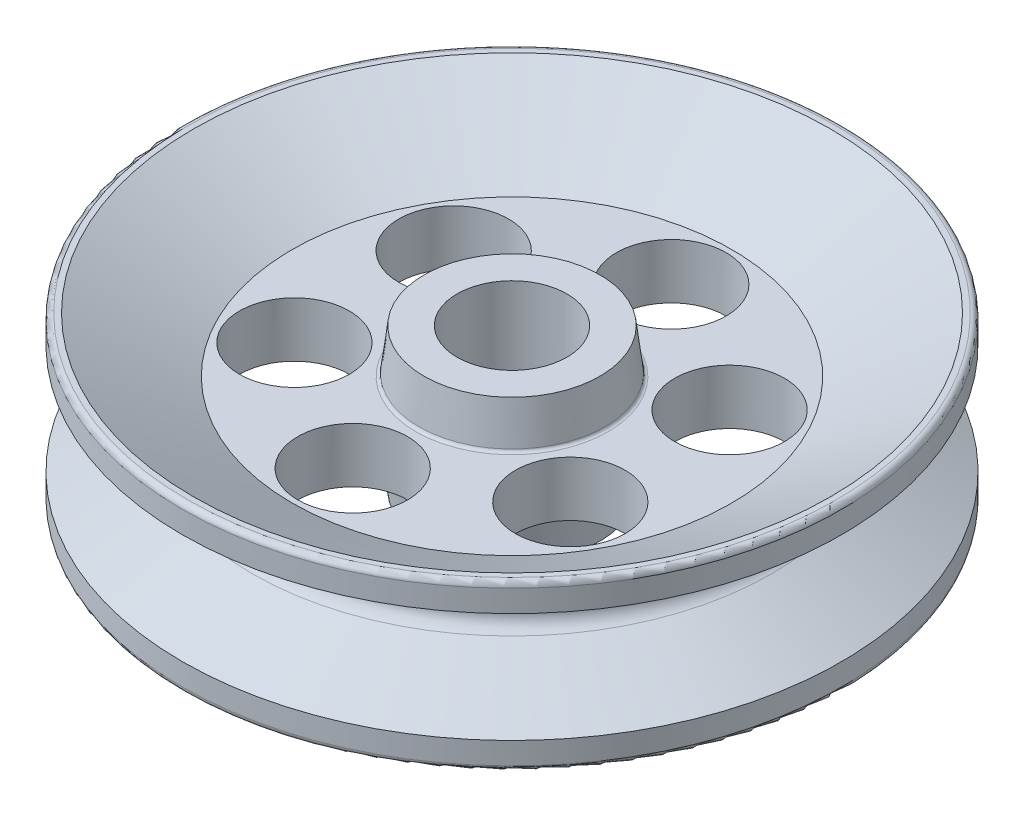
ISO-10303-21;
HEADER;
FILE_DESCRIPTION(('STEP AP214'),'2;1');
FILE_NAME('part.step','',(''),(''),'','','');
FILE_SCHEMA(('AUTOMOTIVE_DESIGN { 1 0 10303 214 1 1 1 1 }'));
ENDSEC;
DATA;
#1=APPLICATION_CONTEXT('core data for automotive mechanical design processes');
#2=APPLICATION_PROTOCOL_DEFINITION('international standard','automotive_design',2000,#1);
#3=PRODUCT_CONTEXT('',#1,'mechanical');
#4=PRODUCT('Part','Part','',(#3));
#5=PRODUCT_RELATED_PRODUCT_CATEGORY('part','',(#4));
#6=PRODUCT_DEFINITION_FORMATION('','',#4);
#7=PRODUCT_DEFINITION_CONTEXT('part definition',#1,'design');
#8=PRODUCT_DEFINITION('design','',#6,#7);
#9=PRODUCT_DEFINITION_SHAPE('','',#8);
#10=(LENGTH_UNIT() NAMED_UNIT(*) SI_UNIT(.MILLI.,.METRE.));
#11=(NAMED_UNIT(*) PLANE_ANGLE_UNIT() SI_UNIT($,.RADIAN.));
#12=(NAMED_UNIT(*) SI_UNIT($,.STERADIAN.) SOLID_ANGLE_UNIT());
#13=UNCERTAINTY_MEASURE_WITH_UNIT(LENGTH_MEASURE(1.E-05),#10,'distance_accuracy_value','');
#14=(GEOMETRIC_REPRESENTATION_CONTEXT(3) GLOBAL_UNCERTAINTY_ASSIGNED_CONTEXT((#13)) GLOBAL_UNIT_ASSIGNED_CONTEXT((#10,
#11,#12)) REPRESENTATION_CONTEXT('',''));
#15=CARTESIAN_POINT('',(0.,0.,0.));
#16=DIRECTION('',(0.,0.,1.));
#17=DIRECTION('',(1.,0.,0.));
#18=AXIS2_PLACEMENT_3D('',#15,#16,#17);
#19=CARTESIAN_POINT('',(0.,-381.,0.));
#20=DIRECTION('',(0.,1.,0.));
#21=DIRECTION('',(0.,0.,1.));
#22=AXIS2_PLACEMENT_3D('',#19,#20,#21);
#23=CYLINDRICAL_SURFACE('',#22,254.);
#24=CARTESIAN_POINT('',(0.,-330.2,0.));
#25=DIRECTION('',(0.,-1.,0.));
#26=DIRECTION('',(0.,0.,-1.));
#27=AXIS2_PLACEMENT_3D('',#24,#25,#26);
#28=CIRCLE('',#27,254.);
#29=CARTESIAN_POINT('',(0.,-330.2,-254.));
#30=VERTEX_POINT('',#29);
#31=EDGE_CURVE('E67',#30,#30,#28,.F.);
#32=ORIENTED_EDGE('',*,*,#31,.F.);
#33=EDGE_LOOP('',(#32));
#34=FACE_BOUND('',#33,.T.);
#35=CARTESIAN_POINT('',(0.,330.2,0.));
#36=DIRECTION('',(0.,1.,0.));
#37=DIRECTION('',(0.,0.,1.));
#38=AXIS2_PLACEMENT_3D('',#35,#36,#37);
#39=CIRCLE('',#38,254.);
#40=CARTESIAN_POINT('',(0.,330.2,254.));
#41=VERTEX_POINT('',#40);
#42=EDGE_CURVE('E57',#41,#41,#39,.F.);
#43=ORIENTED_EDGE('',*,*,#42,.F.);
#44=EDGE_LOOP('',(#43));
#45=FACE_BOUND('',#44,.T.);
#46=ADVANCED_FACE('F36',(#34,#45),#23,.F.);
#47=CARTESIAN_POINT('',(0.,-381.,-736.6));
#48=DIRECTION('',(0.,1.,0.));
#49=DIRECTION('',(0.,0.,1.));
#50=AXIS2_PLACEMENT_3D('',#47,#48,#49);
#51=CYLINDRICAL_SURFACE('',#50,254.);
#52=CARTESIAN_POINT('',(0.,-127.,-736.6));
#53=DIRECTION('',(0.,-1.,0.));
#54=DIRECTION('',(0.,0.,-1.));
#55=AXIS2_PLACEMENT_3D('',#52,#53,#54);
#56=CIRCLE('',#55,254.);
#57=CARTESIAN_POINT('',(0.,-127.,-990.6));
#58=VERTEX_POINT('',#57);
#59=EDGE_CURVE('E71',#58,#58,#56,.F.);
#60=ORIENTED_EDGE('',*,*,#59,.F.);
#61=EDGE_LOOP('',(#60));
#62=FACE_BOUND('',#61,.T.);
#63=CARTESIAN_POINT('',(0.,127.,-736.6));
#64=DIRECTION('',(0.,1.,0.));
#65=DIRECTION('',(0.,0.,1.));
#66=AXIS2_PLACEMENT_3D('',#63,#64,#65);
#67=CIRCLE('',#66,254.);
#68=CARTESIAN_POINT('',(0.,127.,-482.6));
#69=VERTEX_POINT('',#68);
#70=EDGE_CURVE('E61',#69,#69,#67,.F.);
#71=ORIENTED_EDGE('',*,*,#70,.F.);
#72=EDGE_LOOP('',(#71));
#73=FACE_BOUND('',#72,.T.);
#74=ADVANCED_FACE('F162',(#62,#73),#51,.F.);
#75=CARTESIAN_POINT('',(-637.914312427618,-381.,-368.299999999999));
#76=DIRECTION('',(0.,1.,0.));
#77=DIRECTION('',(0.,0.,1.));
#78=AXIS2_PLACEMENT_3D('',#75,#76,#77);
#79=CYLINDRICAL_SURFACE('',#78,254.);
#80=CARTESIAN_POINT('',(-637.914312427618,-127.,-368.299999999999));
#81=DIRECTION('',(0.,-1.,0.));
#82=DIRECTION('',(0.,0.,-1.));
#83=AXIS2_PLACEMENT_3D('',#80,#81,#82);
#84=CIRCLE('',#83,254.);
#85=CARTESIAN_POINT('',(-637.914312427618,-127.,-622.299999999998));
#86=VERTEX_POINT('',#85);
#87=EDGE_CURVE('E89',#86,#86,#84,.F.);
#88=ORIENTED_EDGE('',*,*,#87,.F.);
#89=EDGE_LOOP('',(#88));
#90=FACE_BOUND('',#89,.T.);
#91=CARTESIAN_POINT('',(-637.914312427618,127.,-368.299999999999));
#92=DIRECTION('',(0.,1.,0.));
#93=DIRECTION('',(0.,0.,1.));
#94=AXIS2_PLACEMENT_3D('',#91,#92,#93);
#95=CIRCLE('',#94,254.);
#96=CARTESIAN_POINT('',(-637.914312427618,127.,-114.299999999999));
#97=VERTEX_POINT('',#96);
#98=EDGE_CURVE('E115',#97,#97,#95,.F.);
#99=ORIENTED_EDGE('',*,*,#98,.F.);
#100=EDGE_LOOP('',(#99));
#101=FACE_BOUND('',#100,.T.);
#102=ADVANCED_FACE('F164',(#90,#101),#79,.F.);
#103=CARTESIAN_POINT('',(637.914312427613,-381.,-368.300000000007));
#104=DIRECTION('',(0.,1.,0.));
#105=DIRECTION('',(0.,0.,1.));
#106=AXIS2_PLACEMENT_3D('',#103,#104,#105);
#107=CYLINDRICAL_SURFACE('',#106,254.);
#108=CARTESIAN_POINT('',(637.914312427613,-127.,-368.300000000007));
#109=DIRECTION('',(0.,-1.,0.));
#110=DIRECTION('',(0.,0.,-1.));
#111=AXIS2_PLACEMENT_3D('',#108,#109,#110);
#112=CIRCLE('',#111,254.);
#113=CARTESIAN_POINT('',(637.914312427613,-127.,-622.300000000007));
#114=VERTEX_POINT('',#113);
#115=EDGE_CURVE('E92',#114,#114,#112,.F.);
#116=ORIENTED_EDGE('',*,*,#115,.F.);
#117=EDGE_LOOP('',(#116));
#118=FACE_BOUND('',#117,.T.);
#119=CARTESIAN_POINT('',(637.914312427613,127.,-368.300000000007));
#120=DIRECTION('',(0.,1.,0.));
#121=DIRECTION('',(0.,0.,1.));
#122=AXIS2_PLACEMENT_3D('',#119,#120,#121);
#123=CIRCLE('',#122,254.);
#124=CARTESIAN_POINT('',(637.914312427613,127.,-114.300000000007));
#125=VERTEX_POINT('',#124);
#126=EDGE_CURVE('E118',#125,#125,#123,.F.);
#127=ORIENTED_EDGE('',*,*,#126,.F.);
#128=EDGE_LOOP('',(#127));
#129=FACE_BOUND('',#128,.T.);
#130=ADVANCED_FACE('F171',(#118,#129),#107,.F.);
#131=CARTESIAN_POINT('',(637.914312427621,-381.,368.299999999994));
#132=DIRECTION('',(0.,1.,0.));
#133=DIRECTION('',(0.,0.,1.));
#134=AXIS2_PLACEMENT_3D('',#131,#132,#133);
#135=CYLINDRICAL_SURFACE('',#134,254.);
#136=CARTESIAN_POINT('',(637.914312427621,-127.,368.299999999994));
#137=DIRECTION('',(0.,-1.,0.));
#138=DIRECTION('',(0.,0.,-1.));
#139=AXIS2_PLACEMENT_3D('',#136,#137,#138);
#140=CIRCLE('',#139,254.);
#141=CARTESIAN_POINT('',(637.914312427621,-127.,114.299999999994));
#142=VERTEX_POINT('',#141);
#143=EDGE_CURVE('E95',#142,#142,#140,.F.);
#144=ORIENTED_EDGE('',*,*,#143,.F.);
#145=EDGE_LOOP('',(#144));
#146=FACE_BOUND('',#145,.T.);
#147=CARTESIAN_POINT('',(637.914312427621,127.,368.299999999994));
#148=DIRECTION('',(0.,1.,0.));
#149=DIRECTION('',(0.,0.,1.));
#150=AXIS2_PLACEMENT_3D('',#147,#148,#149);
#151=CIRCLE('',#150,254.);
#152=CARTESIAN_POINT('',(637.914312427621,127.,622.299999999994));
#153=VERTEX_POINT('',#152);
#154=EDGE_CURVE('E121',#153,#153,#151,.F.);
#155=ORIENTED_EDGE('',*,*,#154,.F.);
#156=EDGE_LOOP('',(#155));
#157=FACE_BOUND('',#156,.T.);
#158=ADVANCED_FACE('F262',(#146,#157),#135,.F.);
#159=CARTESIAN_POINT('',(0.,-381.,736.6));
#160=DIRECTION('',(0.,1.,0.));
#161=DIRECTION('',(0.,0.,1.));
#162=AXIS2_PLACEMENT_3D('',#159,#160,#161);
#163=CYLINDRICAL_SURFACE('',#162,254.);
#164=CARTESIAN_POINT('',(0.,-127.,736.6));
#165=DIRECTION('',(0.,-1.,0.));
#166=DIRECTION('',(0.,0.,-1.));
#167=AXIS2_PLACEMENT_3D('',#164,#165,#166);
#168=CIRCLE('',#167,254.);
#169=CARTESIAN_POINT('',(0.,-127.,482.6));
#170=VERTEX_POINT('',#169);
#171=EDGE_CURVE('E75',#170,#170,#168,.F.);
#172=ORIENTED_EDGE('',*,*,#171,.F.);
#173=EDGE_LOOP('',(#172));
#174=FACE_BOUND('',#173,.T.);
#175=CARTESIAN_POINT('',(0.,127.,736.6));
#176=DIRECTION('',(0.,1.,0.));
#177=DIRECTION('',(0.,0.,1.));
#178=AXIS2_PLACEMENT_3D('',#175,#176,#177);
#179=CIRCLE('',#178,254.);
#180=CARTESIAN_POINT('',(0.,127.,990.6));
#181=VERTEX_POINT('',#180);
#182=EDGE_CURVE('E65',#181,#181,#179,.F.);
#183=ORIENTED_EDGE('',*,*,#182,.F.);
#184=EDGE_LOOP('',(#183));
#185=FACE_BOUND('',#184,.T.);
#186=ADVANCED_FACE('F258',(#174,#185),#163,.F.);
#187=CARTESIAN_POINT('',(-637.914312427616,-381.,368.300000000003));
#188=DIRECTION('',(0.,1.,0.));
#189=DIRECTION('',(0.,0.,1.));
#190=AXIS2_PLACEMENT_3D('',#187,#188,#189);
#191=CYLINDRICAL_SURFACE('',#190,254.);
#192=CARTESIAN_POINT('',(-637.914312427616,-127.,368.300000000003));
#193=DIRECTION('',(0.,-1.,0.));
#194=DIRECTION('',(0.,0.,-1.));
#195=AXIS2_PLACEMENT_3D('',#192,#193,#194);
#196=CIRCLE('',#195,254.);
#197=CARTESIAN_POINT('',(-637.914312427616,-127.,114.300000000003));
#198=VERTEX_POINT('',#197);
#199=EDGE_CURVE('E72',#198,#198,#196,.F.);
#200=ORIENTED_EDGE('',*,*,#199,.F.);
#201=EDGE_LOOP('',(#200));
#202=FACE_BOUND('',#201,.T.);
#203=CARTESIAN_POINT('',(-637.914312427616,127.,368.300000000003));
#204=DIRECTION('',(0.,1.,0.));
#205=DIRECTION('',(0.,0.,1.));
#206=AXIS2_PLACEMENT_3D('',#203,#204,#205);
#207=CIRCLE('',#206,254.);
#208=CARTESIAN_POINT('',(-637.914312427616,127.,622.300000000003));
#209=VERTEX_POINT('',#208);
#210=EDGE_CURVE('E62',#209,#209,#207,.F.);
#211=ORIENTED_EDGE('',*,*,#210,.F.);
#212=EDGE_LOOP('',(#211));
#213=FACE_BOUND('',#212,.T.);
#214=ADVANCED_FACE('F201',(#202,#213),#191,.F.);
#215=CARTESIAN_POINT('',(0.,381.,0.));
#216=DIRECTION('',(0.,-1.,0.));
#217=DIRECTION('',(0.,0.,-1.));
#218=AXIS2_PLACEMENT_3D('',#215,#216,#217);
#219=CYLINDRICAL_SURFACE('',#218,1524.);
#220=CARTESIAN_POINT('',(0.,355.6,0.));
#221=DIRECTION('',(0.,1.,0.));
#222=DIRECTION('',(0.,0.,1.));
#223=AXIS2_PLACEMENT_3D('',#220,#221,#222);
#224=CIRCLE('',#223,1524.);
#225=CARTESIAN_POINT('',(0.,355.6,1524.));
#226=VERTEX_POINT('',#225);
#227=EDGE_CURVE('E47',#226,#226,#224,.F.);
#228=ORIENTED_EDGE('',*,*,#227,.T.);
#229=EDGE_LOOP('',(#228));
#230=FACE_BOUND('',#229,.T.);
#231=CARTESIAN_POINT('',(0.,254.,0.));
#232=DIRECTION('',(0.,1.,0.));
#233=DIRECTION('',(0.,0.,1.));
#234=AXIS2_PLACEMENT_3D('',#231,#232,#233);
#235=CIRCLE('',#234,1524.);
#236=CARTESIAN_POINT('',(0.,254.,1524.));
#237=VERTEX_POINT('',#236);
#238=EDGE_CURVE('E70',#237,#237,#235,.T.);
#239=ORIENTED_EDGE('',*,*,#238,.T.);
#240=EDGE_LOOP('',(#239));
#241=FACE_BOUND('',#240,.T.);
#242=ADVANCED_FACE('F195',(#230,#241),#219,.T.);
#243=CARTESIAN_POINT('',(0.,381.,0.));
#244=DIRECTION('',(0.,1.,0.));
#245=DIRECTION('',(0.,0.,1.));
#246=AXIS2_PLACEMENT_3D('',#243,#244,#245);
#247=PLANE('',#246);
#248=CARTESIAN_POINT('',(0.,381.,0.));
#249=DIRECTION('',(0.,1.,0.));
#250=DIRECTION('',(0.,0.,1.));
#251=AXIS2_PLACEMENT_3D('',#248,#249,#250);
#252=CIRCLE('',#251,1498.6);
#253=CARTESIAN_POINT('',(0.,381.,1498.6));
#254=VERTEX_POINT('',#253);
#255=EDGE_CURVE('E51',#254,#254,#252,.T.);
#256=ORIENTED_EDGE('',*,*,#255,.T.);
#257=EDGE_LOOP('',(#256));
#258=FACE_BOUND('',#257,.T.);
#259=CARTESIAN_POINT('',(0.,381.,0.));
#260=DIRECTION('',(0.,1.,0.));
#261=DIRECTION('',(0.,0.,1.));
#262=AXIS2_PLACEMENT_3D('',#259,#260,#261);
#263=CIRCLE('',#262,1473.2);
#264=CARTESIAN_POINT('',(0.,381.,1473.2));
#265=VERTEX_POINT('',#264);
#266=EDGE_CURVE('E131',#265,#265,#263,.T.);
#267=ORIENTED_EDGE('',*,*,#266,.F.);
#268=EDGE_LOOP('',(#267));
#269=FACE_BOUND('',#268,.T.);
#270=ADVANCED_FACE('F191',(#258,#269),#247,.T.);
#271=CARTESIAN_POINT('',(0.,254.,0.));
#272=DIRECTION('',(0.,1.,0.));
#273=DIRECTION('',(0.,0.,1.));
#274=AXIS2_PLACEMENT_3D('',#271,#272,#273);
#275=CONICAL_SURFACE('',#274,1524.,1.0471975511966);
#276=CARTESIAN_POINT('',(0.,65.9911357683741,0.));
#277=DIRECTION('',(0.,1.,0.));
#278=DIRECTION('',(0.,0.,1.));
#279=AXIS2_PLACEMENT_3D('',#276,#277,#278);
#280=CIRCLE('',#279,1198.35909487751);
#281=CARTESIAN_POINT('',(0.,65.9911357683741,1198.35909487751));
#282=VERTEX_POINT('',#281);
#283=EDGE_CURVE('E56',#282,#282,#280,.T.);
#284=ORIENTED_EDGE('',*,*,#283,.T.);
#285=EDGE_LOOP('',(#284));
#286=FACE_BOUND('',#285,.T.);
#287=ORIENTED_EDGE('',*,*,#238,.F.);
#288=EDGE_LOOP('',(#287));
#289=FACE_BOUND('',#288,.T.);
#290=ADVANCED_FACE('F187',(#286,#289),#275,.T.);
#291=CARTESIAN_POINT('',(0.,0.,0.));
#292=DIRECTION('',(0.,1.,0.));
#293=DIRECTION('',(0.,0.,1.));
#294=AXIS2_PLACEMENT_3D('',#291,#292,#293);
#295=TOROIDAL_SURFACE('',#294,1236.45909487751,76.2);
#296=CARTESIAN_POINT('',(0.,-65.9911357683741,0.));
#297=DIRECTION('',(0.,1.,0.));
#298=DIRECTION('',(0.,0.,1.));
#299=AXIS2_PLACEMENT_3D('',#296,#297,#298);
#300=CIRCLE('',#299,1198.35909487751);
#301=CARTESIAN_POINT('',(0.,-65.9911357683741,1198.35909487751));
#302=VERTEX_POINT('',#301);
#303=EDGE_CURVE('E79',#302,#302,#300,.T.);
#304=ORIENTED_EDGE('',*,*,#303,.T.);
#305=EDGE_LOOP('',(#304));
#306=FACE_BOUND('',#305,.T.);
#307=ORIENTED_EDGE('',*,*,#283,.F.);
#308=EDGE_LOOP('',(#307));
#309=FACE_BOUND('',#308,.T.);
#310=ADVANCED_FACE('F183',(#306,#309),#295,.F.);
#311=CARTESIAN_POINT('',(0.,-65.9911357683741,0.));
#312=DIRECTION('',(0.,-1.,0.));
#313=DIRECTION('',(0.,0.,-1.));
#314=AXIS2_PLACEMENT_3D('',#311,#312,#313);
#315=CONICAL_SURFACE('',#314,1198.35909487751,1.0471975511966);
#316=CARTESIAN_POINT('',(0.,-254.,0.));
#317=DIRECTION('',(0.,1.,0.));
#318=DIRECTION('',(0.,0.,1.));
#319=AXIS2_PLACEMENT_3D('',#316,#317,#318);
#320=CIRCLE('',#319,1524.);
#321=CARTESIAN_POINT('',(0.,-254.,1524.));
#322=VERTEX_POINT('',#321);
#323=EDGE_CURVE('E82',#322,#322,#320,.T.);
#324=ORIENTED_EDGE('',*,*,#323,.T.);
#325=EDGE_LOOP('',(#324));
#326=FACE_BOUND('',#325,.T.);
#327=ORIENTED_EDGE('',*,*,#303,.F.);
#328=EDGE_LOOP('',(#327));
#329=FACE_BOUND('',#328,.T.);
#330=ADVANCED_FACE('F179',(#326,#329),#315,.T.);
#331=CARTESIAN_POINT('',(0.,-381.,0.));
#332=DIRECTION('',(0.,1.,0.));
#333=DIRECTION('',(0.,0.,1.));
#334=AXIS2_PLACEMENT_3D('',#331,#332,#333);
#335=PLANE('',#334);
#336=CARTESIAN_POINT('',(0.,-381.,0.));
#337=DIRECTION('',(0.,1.,0.));
#338=DIRECTION('',(0.,0.,1.));
#339=AXIS2_PLACEMENT_3D('',#336,#337,#338);
#340=CIRCLE('',#339,1498.6);
#341=CARTESIAN_POINT('',(0.,-381.,1498.6));
#342=VERTEX_POINT('',#341);
#343=EDGE_CURVE('E10',#342,#342,#340,.F.);
#344=ORIENTED_EDGE('',*,*,#343,.T.);
#345=EDGE_LOOP('',(#344));
#346=FACE_BOUND('',#345,.T.);
#347=CARTESIAN_POINT('',(0.,-381.,0.));
#348=DIRECTION('',(0.,1.,0.));
#349=DIRECTION('',(0.,0.,1.));
#350=AXIS2_PLACEMENT_3D('',#347,#348,#349);
#351=CIRCLE('',#350,1473.2);
#352=CARTESIAN_POINT('',(0.,-381.,1473.2));
#353=VERTEX_POINT('',#352);
#354=EDGE_CURVE('E76',#353,#353,#351,.T.);
#355=ORIENTED_EDGE('',*,*,#354,.T.);
#356=EDGE_LOOP('',(#355));
#357=FACE_BOUND('',#356,.T.);
#358=ADVANCED_FACE('F182',(#346,#357),#335,.F.);
#359=CARTESIAN_POINT('',(0.,-355.6,0.));
#360=DIRECTION('',(0.,1.,0.));
#361=DIRECTION('',(0.,0.,1.));
#362=AXIS2_PLACEMENT_3D('',#359,#360,#361);
#363=CIRCLE('',#362,1524.);
#364=CARTESIAN_POINT('',(0.,-355.6,1524.));
#365=VERTEX_POINT('',#364);
#366=EDGE_CURVE('E43',#365,#365,#363,.T.);
#367=ORIENTED_EDGE('',*,*,#366,.T.);
#368=EDGE_LOOP('',(#367));
#369=FACE_BOUND('',#368,.T.);
#370=ORIENTED_EDGE('',*,*,#323,.F.);
#371=EDGE_LOOP('',(#370));
#372=FACE_BOUND('',#371,.T.);
#373=ADVANCED_FACE('F199',(#369,#372),#219,.T.);
#374=CARTESIAN_POINT('',(0.,-330.2,0.));
#375=DIRECTION('',(0.,-1.,0.));
#376=DIRECTION('',(0.,0.,-1.));
#377=AXIS2_PLACEMENT_3D('',#374,#375,#376);
#378=PLANE('',#377);
#379=CARTESIAN_POINT('',(0.,-330.2,0.));
#380=DIRECTION('',(0.,1.,0.));
#381=DIRECTION('',(0.,0.,1.));
#382=AXIS2_PLACEMENT_3D('',#379,#380,#381);
#383=CIRCLE('',#382,406.4);
#384=CARTESIAN_POINT('',(0.,-330.2,406.4));
#385=VERTEX_POINT('',#384);
#386=EDGE_CURVE('E60',#385,#385,#383,.T.);
#387=ORIENTED_EDGE('',*,*,#386,.F.);
#388=EDGE_LOOP('',(#387));
#389=FACE_BOUND('',#388,.T.);
#390=ORIENTED_EDGE('',*,*,#31,.T.);
#391=EDGE_LOOP('',(#390));
#392=FACE_BOUND('',#391,.T.);
#393=ADVANCED_FACE('F248',(#389,#392),#378,.T.);
#394=CARTESIAN_POINT('',(0.,-127.,-1016.));
#395=DIRECTION('',(0.,-1.,0.));
#396=DIRECTION('',(0.,0.,-1.));
#397=AXIS2_PLACEMENT_3D('',#394,#395,#396);
#398=PLANE('',#397);
#399=CARTESIAN_POINT('',(0.,-127.,0.));
#400=DIRECTION('',(0.,1.,0.));
#401=DIRECTION('',(0.,0.,1.));
#402=AXIS2_PLACEMENT_3D('',#399,#400,#401);
#403=CIRCLE('',#402,444.5);
#404=CARTESIAN_POINT('',(0.,-127.,444.5));
#405=VERTEX_POINT('',#404);
#406=EDGE_CURVE('E105',#405,#405,#403,.T.);
#407=ORIENTED_EDGE('',*,*,#406,.T.);
#408=EDGE_LOOP('',(#407));
#409=FACE_BOUND('',#408,.T.);
#410=CARTESIAN_POINT('',(0.,-127.,0.));
#411=DIRECTION('',(0.,1.,0.));
#412=DIRECTION('',(0.,0.,1.));
#413=AXIS2_PLACEMENT_3D('',#410,#411,#412);
#414=CIRCLE('',#413,1016.);
#415=CARTESIAN_POINT('',(0.,-127.,1016.));
#416=VERTEX_POINT('',#415);
#417=EDGE_CURVE('E102',#416,#416,#414,.T.);
#418=ORIENTED_EDGE('',*,*,#417,.F.);
#419=EDGE_LOOP('',(#418));
#420=FACE_BOUND('',#419,.T.);
#421=ORIENTED_EDGE('',*,*,#199,.T.);
#422=EDGE_LOOP('',(#421));
#423=FACE_BOUND('',#422,.T.);
#424=ORIENTED_EDGE('',*,*,#171,.T.);
#425=EDGE_LOOP('',(#424));
#426=FACE_BOUND('',#425,.T.);
#427=ORIENTED_EDGE('',*,*,#143,.T.);
#428=EDGE_LOOP('',(#427));
#429=FACE_BOUND('',#428,.T.);
#430=ORIENTED_EDGE('',*,*,#115,.T.);
#431=EDGE_LOOP('',(#430));
#432=FACE_BOUND('',#431,.T.);
#433=ORIENTED_EDGE('',*,*,#87,.T.);
#434=EDGE_LOOP('',(#433));
#435=FACE_BOUND('',#434,.T.);
#436=ORIENTED_EDGE('',*,*,#59,.T.);
#437=EDGE_LOOP('',(#436));
#438=FACE_BOUND('',#437,.T.);
#439=ADVANCED_FACE('F245',(#409,#420,#423,#426,#429,#432,#435,#438),#398,.T.);
#440=CARTESIAN_POINT('',(0.,-381.,0.));
#441=DIRECTION('',(0.,-1.,0.));
#442=DIRECTION('',(0.,0.,-1.));
#443=AXIS2_PLACEMENT_3D('',#440,#441,#442);
#444=CONICAL_SURFACE('',#443,1473.2,1.06369782240256);
#445=ORIENTED_EDGE('',*,*,#417,.T.);
#446=EDGE_LOOP('',(#445));
#447=FACE_BOUND('',#446,.T.);
#448=ORIENTED_EDGE('',*,*,#354,.F.);
#449=EDGE_LOOP('',(#448));
#450=FACE_BOUND('',#449,.T.);
#451=ADVANCED_FACE('F243',(#447,#450),#444,.F.);
#452=CARTESIAN_POINT('',(0.,-141.47353357562,0.));
#453=DIRECTION('',(0.,1.,0.));
#454=DIRECTION('',(0.,0.,1.));
#455=AXIS2_PLACEMENT_3D('',#452,#453,#454);
#456=TOROIDAL_SURFACE('',#455,444.5,14.4735335756199);
#457=CARTESIAN_POINT('',(0.,-139.684026624641,0.));
#458=DIRECTION('',(0.,1.,0.));
#459=DIRECTION('',(0.,0.,1.));
#460=AXIS2_PLACEMENT_3D('',#457,#458,#459);
#461=CIRCLE('',#460,430.137519746332);
#462=CARTESIAN_POINT('',(0.,-139.684026624641,430.137519746332));
#463=VERTEX_POINT('',#462);
#464=EDGE_CURVE('E108',#463,#463,#461,.T.);
#465=ORIENTED_EDGE('',*,*,#464,.T.);
#466=EDGE_LOOP('',(#465));
#467=FACE_BOUND('',#466,.T.);
#468=ORIENTED_EDGE('',*,*,#406,.F.);
#469=EDGE_LOOP('',(#468));
#470=FACE_BOUND('',#469,.T.);
#471=ADVANCED_FACE('F239',(#467,#470),#456,.F.);
#472=CARTESIAN_POINT('',(0.,-139.684026624641,0.));
#473=DIRECTION('',(0.,1.,0.));
#474=DIRECTION('',(0.,0.,1.));
#475=AXIS2_PLACEMENT_3D('',#472,#473,#474);
#476=CONICAL_SURFACE('',#475,430.137519746332,0.123957146381599);
#477=ORIENTED_EDGE('',*,*,#386,.T.);
#478=EDGE_LOOP('',(#477));
#479=FACE_BOUND('',#478,.T.);
#480=ORIENTED_EDGE('',*,*,#464,.F.);
#481=EDGE_LOOP('',(#480));
#482=FACE_BOUND('',#481,.T.);
#483=ADVANCED_FACE('F232',(#479,#482),#476,.T.);
#484=CARTESIAN_POINT('',(0.,330.2,0.));
#485=DIRECTION('',(0.,1.,0.));
#486=DIRECTION('',(0.,0.,1.));
#487=AXIS2_PLACEMENT_3D('',#484,#485,#486);
#488=PLANE('',#487);
#489=CARTESIAN_POINT('',(0.,330.2,0.));
#490=DIRECTION('',(0.,1.,0.));
#491=DIRECTION('',(0.,0.,1.));
#492=AXIS2_PLACEMENT_3D('',#489,#490,#491);
#493=CIRCLE('',#492,406.4);
#494=CARTESIAN_POINT('',(0.,330.2,406.4));
#495=VERTEX_POINT('',#494);
#496=EDGE_CURVE('E128',#495,#495,#493,.T.);
#497=ORIENTED_EDGE('',*,*,#496,.T.);
#498=EDGE_LOOP('',(#497));
#499=FACE_BOUND('',#498,.T.);
#500=ORIENTED_EDGE('',*,*,#42,.T.);
#501=EDGE_LOOP('',(#500));
#502=FACE_BOUND('',#501,.T.);
#503=ADVANCED_FACE('F147',(#499,#502),#488,.T.);
#504=CARTESIAN_POINT('',(0.,127.,-1016.));
#505=DIRECTION('',(0.,1.,0.));
#506=DIRECTION('',(0.,0.,1.));
#507=AXIS2_PLACEMENT_3D('',#504,#505,#506);
#508=PLANE('',#507);
#509=CARTESIAN_POINT('',(0.,127.,0.));
#510=DIRECTION('',(0.,1.,0.));
#511=DIRECTION('',(0.,0.,1.));
#512=AXIS2_PLACEMENT_3D('',#509,#510,#511);
#513=CIRCLE('',#512,1016.);
#514=CARTESIAN_POINT('',(0.,127.,1016.));
#515=VERTEX_POINT('',#514);
#516=EDGE_CURVE('E134',#515,#515,#513,.T.);
#517=ORIENTED_EDGE('',*,*,#516,.T.);
#518=EDGE_LOOP('',(#517));
#519=FACE_BOUND('',#518,.T.);
#520=CARTESIAN_POINT('',(0.,127.,0.));
#521=DIRECTION('',(0.,1.,0.));
#522=DIRECTION('',(0.,0.,1.));
#523=AXIS2_PLACEMENT_3D('',#520,#521,#522);
#524=CIRCLE('',#523,444.5);
#525=CARTESIAN_POINT('',(0.,127.,444.5));
#526=VERTEX_POINT('',#525);
#527=EDGE_CURVE('E137',#526,#526,#524,.T.);
#528=ORIENTED_EDGE('',*,*,#527,.F.);
#529=EDGE_LOOP('',(#528));
#530=FACE_BOUND('',#529,.T.);
#531=ORIENTED_EDGE('',*,*,#210,.T.);
#532=EDGE_LOOP('',(#531));
#533=FACE_BOUND('',#532,.T.);
#534=ORIENTED_EDGE('',*,*,#182,.T.);
#535=EDGE_LOOP('',(#534));
#536=FACE_BOUND('',#535,.T.);
#537=ORIENTED_EDGE('',*,*,#154,.T.);
#538=EDGE_LOOP('',(#537));
#539=FACE_BOUND('',#538,.T.);
#540=ORIENTED_EDGE('',*,*,#126,.T.);
#541=EDGE_LOOP('',(#540));
#542=FACE_BOUND('',#541,.T.);
#543=ORIENTED_EDGE('',*,*,#98,.T.);
#544=EDGE_LOOP('',(#543));
#545=FACE_BOUND('',#544,.T.);
#546=ORIENTED_EDGE('',*,*,#70,.T.);
#547=EDGE_LOOP('',(#546));
#548=FACE_BOUND('',#547,.T.);
#549=ADVANCED_FACE('F144',(#519,#530,#533,#536,#539,#542,#545,#548),#508,.T.);
#550=CARTESIAN_POINT('',(0.,141.47353357562,0.));
#551=DIRECTION('',(0.,1.,0.));
#552=DIRECTION('',(0.,0.,1.));
#553=AXIS2_PLACEMENT_3D('',#550,#551,#552);
#554=TOROIDAL_SURFACE('',#553,444.5,14.4735335756199);
#555=ORIENTED_EDGE('',*,*,#527,.T.);
#556=EDGE_LOOP('',(#555));
#557=FACE_BOUND('',#556,.T.);
#558=CARTESIAN_POINT('',(0.,139.684026624641,0.));
#559=DIRECTION('',(0.,1.,0.));
#560=DIRECTION('',(0.,0.,1.));
#561=AXIS2_PLACEMENT_3D('',#558,#559,#560);
#562=CIRCLE('',#561,430.137519746333);
#563=CARTESIAN_POINT('',(0.,139.684026624641,430.137519746333));
#564=VERTEX_POINT('',#563);
#565=EDGE_CURVE('E66',#564,#564,#562,.T.);
#566=ORIENTED_EDGE('',*,*,#565,.F.);
#567=EDGE_LOOP('',(#566));
#568=FACE_BOUND('',#567,.T.);
#569=ADVANCED_FACE('F141',(#557,#568),#554,.F.);
#570=CARTESIAN_POINT('',(0.,330.2,0.));
#571=DIRECTION('',(0.,-1.,0.));
#572=DIRECTION('',(0.,0.,-1.));
#573=AXIS2_PLACEMENT_3D('',#570,#571,#572);
#574=CONICAL_SURFACE('',#573,406.4,0.123957146381601);
#575=ORIENTED_EDGE('',*,*,#565,.T.);
#576=EDGE_LOOP('',(#575));
#577=FACE_BOUND('',#576,.T.);
#578=ORIENTED_EDGE('',*,*,#496,.F.);
#579=EDGE_LOOP('',(#578));
#580=FACE_BOUND('',#579,.T.);
#581=ADVANCED_FACE('F212',(#577,#580),#574,.T.);
#582=CARTESIAN_POINT('',(0.,127.,0.));
#583=DIRECTION('',(0.,1.,0.));
#584=DIRECTION('',(0.,0.,1.));
#585=AXIS2_PLACEMENT_3D('',#582,#583,#584);
#586=CONICAL_SURFACE('',#585,1016.,1.06369782240256);
#587=ORIENTED_EDGE('',*,*,#266,.T.);
#588=EDGE_LOOP('',(#587));
#589=FACE_BOUND('',#588,.T.);
#590=ORIENTED_EDGE('',*,*,#516,.F.);
#591=EDGE_LOOP('',(#590));
#592=FACE_BOUND('',#591,.T.);
#593=ADVANCED_FACE('F205',(#589,#592),#586,.F.);
#594=CARTESIAN_POINT('',(0.,355.6,0.));
#595=DIRECTION('',(0.,1.,0.));
#596=DIRECTION('',(0.,0.,1.));
#597=AXIS2_PLACEMENT_3D('',#594,#595,#596);
#598=TOROIDAL_SURFACE('',#597,1498.6,25.4);
#599=ORIENTED_EDGE('',*,*,#227,.F.);
#600=EDGE_LOOP('',(#599));
#601=FACE_BOUND('',#600,.T.);
#602=ORIENTED_EDGE('',*,*,#255,.F.);
#603=EDGE_LOOP('',(#602));
#604=FACE_BOUND('',#603,.T.);
#605=ADVANCED_FACE('F203',(#601,#604),#598,.T.);
#606=CARTESIAN_POINT('',(0.,-355.6,0.));
#607=DIRECTION('',(0.,1.,0.));
#608=DIRECTION('',(0.,0.,1.));
#609=AXIS2_PLACEMENT_3D('',#606,#607,#608);
#610=TOROIDAL_SURFACE('',#609,1498.6,25.4);
#611=ORIENTED_EDGE('',*,*,#343,.F.);
#612=EDGE_LOOP('',(#611));
#613=FACE_BOUND('',#612,.T.);
#614=ORIENTED_EDGE('',*,*,#366,.F.);
#615=EDGE_LOOP('',(#614));
#616=FACE_BOUND('',#615,.T.);
#617=ADVANCED_FACE('F38',(#613,#616),#610,.T.);
#618=CLOSED_SHELL('',(#46,#74,#102,#130,#158,#186,#214,#242,#270,#290,#310,#330,#358,#373,#393,
#439,#451,#471,#483,#503,#549,#569,#581,#593,#605,#617));
#619=MANIFOLD_SOLID_BREP('B2',#618);
#620=ADVANCED_BREP_SHAPE_REPRESENTATION('',(#18,#619),#14);
#621=SHAPE_DEFINITION_REPRESENTATION(#9,#620);
ENDSEC;
END-ISO-10303-21;
